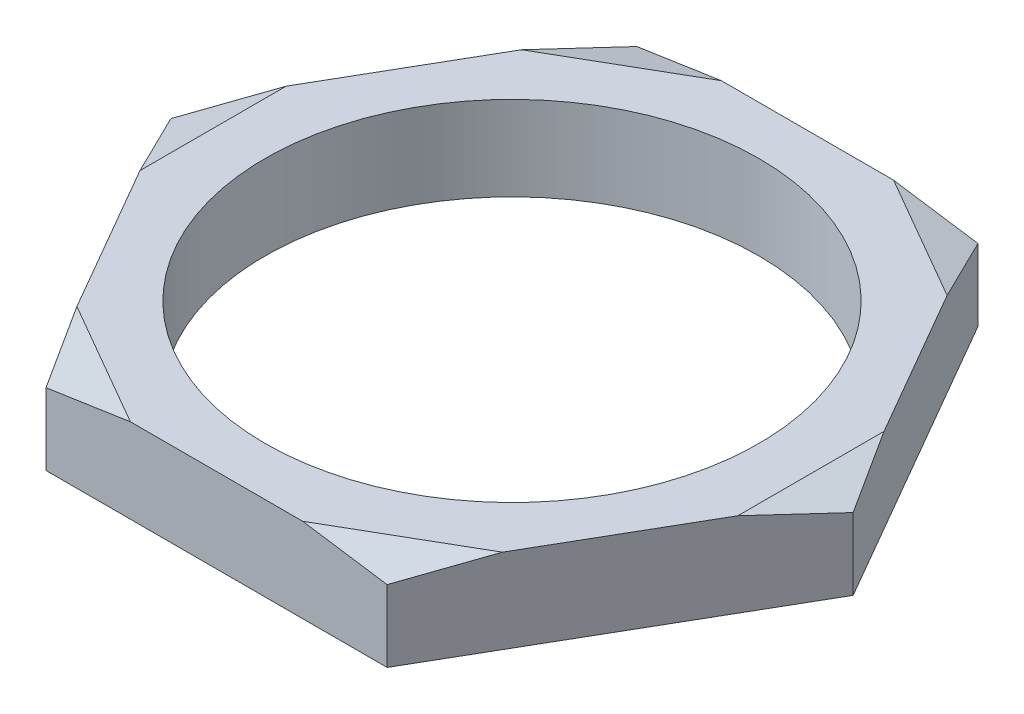
ISO-10303-21;
HEADER;
FILE_DESCRIPTION(('STEP AP214'),'2;1');
FILE_NAME('part.step','',(''),(''),'','','');
FILE_SCHEMA(('AUTOMOTIVE_DESIGN { 1 0 10303 214 1 1 1 1 }'));
ENDSEC;
DATA;
#1=APPLICATION_CONTEXT('core data for automotive mechanical design processes');
#2=APPLICATION_PROTOCOL_DEFINITION('international standard','automotive_design',2000,#1);
#3=PRODUCT_CONTEXT('',#1,'mechanical');
#4=PRODUCT('Part','Part','',(#3));
#5=PRODUCT_RELATED_PRODUCT_CATEGORY('part','',(#4));
#6=PRODUCT_DEFINITION_FORMATION('','',#4);
#7=PRODUCT_DEFINITION_CONTEXT('part definition',#1,'design');
#8=PRODUCT_DEFINITION('design','',#6,#7);
#9=PRODUCT_DEFINITION_SHAPE('','',#8);
#10=(LENGTH_UNIT() NAMED_UNIT(*) SI_UNIT(.MILLI.,.METRE.));
#11=(NAMED_UNIT(*) PLANE_ANGLE_UNIT() SI_UNIT($,.RADIAN.));
#12=(NAMED_UNIT(*) SI_UNIT($,.STERADIAN.) SOLID_ANGLE_UNIT());
#13=UNCERTAINTY_MEASURE_WITH_UNIT(LENGTH_MEASURE(1.E-05),#10,'distance_accuracy_value','');
#14=(GEOMETRIC_REPRESENTATION_CONTEXT(3) GLOBAL_UNCERTAINTY_ASSIGNED_CONTEXT((#13)) GLOBAL_UNIT_ASSIGNED_CONTEXT((#10,
#11,#12)) REPRESENTATION_CONTEXT('',''));
#15=CARTESIAN_POINT('',(0.,0.,0.));
#16=DIRECTION('',(0.,0.,1.));
#17=DIRECTION('',(1.,0.,0.));
#18=AXIS2_PLACEMENT_3D('',#15,#16,#17);
#19=CARTESIAN_POINT('',(0.,2.,0.));
#20=DIRECTION('',(0.,1.,0.));
#21=DIRECTION('',(0.,0.,1.));
#22=AXIS2_PLACEMENT_3D('',#19,#20,#21);
#23=PLANE('',#22);
#24=CARTESIAN_POINT('',(0.,2.,0.));
#25=DIRECTION('',(0.,1.,0.));
#26=DIRECTION('',(0.,0.,1.));
#27=AXIS2_PLACEMENT_3D('',#24,#25,#26);
#28=CIRCLE('',#27,5.85);
#29=CARTESIAN_POINT('',(0.,2.,5.85));
#30=VERTEX_POINT('',#29);
#31=EDGE_CURVE('E207',#30,#30,#28,.T.);
#32=ORIENTED_EDGE('',*,*,#31,.F.);
#33=EDGE_LOOP('',(#32));
#34=FACE_BOUND('',#33,.T.);
#35=DIRECTION('',(-0.499999999999995,0.,0.866025403784442));
#36=VECTOR('',#35,1.);
#37=CARTESIAN_POINT('',(-4.04145188432746,2.,-6.99999999999996));
#38=LINE('',#37,#36);
#39=CARTESIAN_POINT('',(-5.04145188432745,2.,-5.26794919243108));
#40=VERTEX_POINT('',#39);
#41=CARTESIAN_POINT('',(-7.08290376865478,2.,-1.73205080756888));
#42=VERTEX_POINT('',#41);
#43=EDGE_CURVE('E127',#40,#42,#38,.T.);
#44=ORIENTED_EDGE('',*,*,#43,.T.);
#45=DIRECTION('',(0.,0.,1.));
#46=VECTOR('',#45,1.);
#47=CARTESIAN_POINT('',(-7.08290376865477,2.,0.));
#48=LINE('',#47,#46);
#49=CARTESIAN_POINT('',(-7.08290376865476,2.,1.73205080756888));
#50=VERTEX_POINT('',#49);
#51=EDGE_CURVE('E130',#42,#50,#48,.T.);
#52=ORIENTED_EDGE('',*,*,#51,.T.);
#53=DIRECTION('',(0.500000000000001,0.,0.866025403784438));
#54=VECTOR('',#53,1.);
#55=CARTESIAN_POINT('',(-8.08290376865476,2.,0.));
#56=LINE('',#55,#54);
#57=CARTESIAN_POINT('',(-5.04145188432738,2.,5.26794919243113));
#58=VERTEX_POINT('',#57);
#59=EDGE_CURVE('E117',#50,#58,#56,.T.);
#60=ORIENTED_EDGE('',*,*,#59,.T.);
#61=DIRECTION('',(0.86602540378444,0.,0.499999999999998));
#62=VECTOR('',#61,1.);
#63=CARTESIAN_POINT('',(-3.54145188432736,2.,6.13397459621556));
#64=LINE('',#63,#62);
#65=CARTESIAN_POINT('',(-2.04145188432735,2.,7.00000000000001));
#66=VERTEX_POINT('',#65);
#67=EDGE_CURVE('E156',#58,#66,#64,.T.);
#68=ORIENTED_EDGE('',*,*,#67,.T.);
#69=DIRECTION('',(1.,0.,0.));
#70=VECTOR('',#69,1.);
#71=CARTESIAN_POINT('',(-4.04145188432737,2.,7.00000000000001));
#72=LINE('',#71,#70);
#73=CARTESIAN_POINT('',(2.04145188432741,2.,6.99999999999999));
#74=VERTEX_POINT('',#73);
#75=EDGE_CURVE('E126',#66,#74,#72,.T.);
#76=ORIENTED_EDGE('',*,*,#75,.T.);
#77=DIRECTION('',(0.866025403784436,0.,-0.500000000000004));
#78=VECTOR('',#77,1.);
#79=CARTESIAN_POINT('',(3.54145188432741,2.,6.13397459621554));
#80=LINE('',#79,#78);
#81=CARTESIAN_POINT('',(5.04145188432741,2.,5.2679491924311));
#82=VERTEX_POINT('',#81);
#83=EDGE_CURVE('E173',#74,#82,#80,.T.);
#84=ORIENTED_EDGE('',*,*,#83,.T.);
#85=DIRECTION('',(0.499999999999995,0.,-0.866025403784441));
#86=VECTOR('',#85,1.);
#87=CARTESIAN_POINT('',(4.04145188432742,2.,6.99999999999998));
#88=LINE('',#87,#86);
#89=CARTESIAN_POINT('',(7.08290376865477,2.,1.73205080756883));
#90=VERTEX_POINT('',#89);
#91=EDGE_CURVE('E213',#82,#90,#88,.T.);
#92=ORIENTED_EDGE('',*,*,#91,.T.);
#93=DIRECTION('',(0.,0.,-1.));
#94=VECTOR('',#93,1.);
#95=CARTESIAN_POINT('',(7.08290376865476,2.,0.));
#96=LINE('',#95,#94);
#97=CARTESIAN_POINT('',(7.08290376865475,2.,-1.73205080756893));
#98=VERTEX_POINT('',#97);
#99=EDGE_CURVE('E164',#90,#98,#96,.T.);
#100=ORIENTED_EDGE('',*,*,#99,.T.);
#101=DIRECTION('',(-0.500000000000007,0.,-0.866025403784435));
#102=VECTOR('',#101,1.);
#103=CARTESIAN_POINT('',(8.08290376865476,2.,0.));
#104=LINE('',#103,#102);
#105=CARTESIAN_POINT('',(5.04145188432733,2.,-5.26794919243118));
#106=VERTEX_POINT('',#105);
#107=EDGE_CURVE('E210',#98,#106,#104,.T.);
#108=ORIENTED_EDGE('',*,*,#107,.T.);
#109=DIRECTION('',(-0.866025403784443,0.,-0.499999999999992));
#110=VECTOR('',#109,1.);
#111=CARTESIAN_POINT('',(3.54145188432733,2.,-6.1339745962156));
#112=LINE('',#111,#110);
#113=CARTESIAN_POINT('',(2.04145188432732,2.,-7.00000000000002));
#114=VERTEX_POINT('',#113);
#115=EDGE_CURVE('E149',#106,#114,#112,.T.);
#116=ORIENTED_EDGE('',*,*,#115,.T.);
#117=DIRECTION('',(-1.,0.,0.));
#118=VECTOR('',#117,1.);
#119=CARTESIAN_POINT('',(4.04145188432732,2.,-7.00000000000004));
#120=LINE('',#119,#118);
#121=CARTESIAN_POINT('',(-2.04145188432747,2.,-6.99999999999998));
#122=VERTEX_POINT('',#121);
#123=EDGE_CURVE('E188',#114,#122,#120,.T.);
#124=ORIENTED_EDGE('',*,*,#123,.T.);
#125=DIRECTION('',(-0.866025403784434,0.,0.500000000000007));
#126=VECTOR('',#125,1.);
#127=CARTESIAN_POINT('',(-3.54145188432744,2.,-6.13397459621554));
#128=LINE('',#127,#126);
#129=EDGE_CURVE('E141',#122,#40,#128,.T.);
#130=ORIENTED_EDGE('',*,*,#129,.T.);
#131=EDGE_LOOP('',(#44,#52,#60,#68,#76,#84,#92,#100,#108,#116,#124,#130));
#132=FACE_BOUND('',#131,.T.);
#133=ADVANCED_FACE('F32',(#34,#132),#23,.T.);
#134=CARTESIAN_POINT('',(0.,0.,0.));
#135=DIRECTION('',(0.,1.,0.));
#136=DIRECTION('',(0.,0.,1.));
#137=AXIS2_PLACEMENT_3D('',#134,#135,#136);
#138=PLANE('',#137);
#139=DIRECTION('',(-0.499999999999995,0.,0.866025403784442));
#140=VECTOR('',#139,1.);
#141=CARTESIAN_POINT('',(-4.04145188432746,0.,-6.99999999999996));
#142=LINE('',#141,#140);
#143=CARTESIAN_POINT('',(-4.04145188432746,0.,-6.99999999999996));
#144=VERTEX_POINT('',#143);
#145=CARTESIAN_POINT('',(-8.08290376865476,0.,0.));
#146=VERTEX_POINT('',#145);
#147=EDGE_CURVE('E204',#144,#146,#142,.T.);
#148=ORIENTED_EDGE('',*,*,#147,.F.);
#149=DIRECTION('',(-1.,0.,0.));
#150=VECTOR('',#149,1.);
#151=CARTESIAN_POINT('',(4.04145188432732,0.,-7.00000000000004));
#152=LINE('',#151,#150);
#153=CARTESIAN_POINT('',(4.04145188432732,0.,-7.00000000000004));
#154=VERTEX_POINT('',#153);
#155=EDGE_CURVE('E189',#154,#144,#152,.T.);
#156=ORIENTED_EDGE('',*,*,#155,.F.);
#157=DIRECTION('',(-0.500000000000007,0.,-0.866025403784435));
#158=VECTOR('',#157,1.);
#159=CARTESIAN_POINT('',(8.08290376865476,0.,0.));
#160=LINE('',#159,#158);
#161=CARTESIAN_POINT('',(8.08290376865476,0.,0.));
#162=VERTEX_POINT('',#161);
#163=EDGE_CURVE('E192',#162,#154,#160,.T.);
#164=ORIENTED_EDGE('',*,*,#163,.F.);
#165=DIRECTION('',(0.499999999999995,0.,-0.866025403784441));
#166=VECTOR('',#165,1.);
#167=CARTESIAN_POINT('',(4.04145188432742,0.,6.99999999999998));
#168=LINE('',#167,#166);
#169=CARTESIAN_POINT('',(4.04145188432742,0.,6.99999999999998));
#170=VERTEX_POINT('',#169);
#171=EDGE_CURVE('E195',#170,#162,#168,.T.);
#172=ORIENTED_EDGE('',*,*,#171,.F.);
#173=DIRECTION('',(1.,0.,0.));
#174=VECTOR('',#173,1.);
#175=CARTESIAN_POINT('',(-4.04145188432737,0.,7.00000000000001));
#176=LINE('',#175,#174);
#177=CARTESIAN_POINT('',(-4.04145188432737,0.,7.00000000000001));
#178=VERTEX_POINT('',#177);
#179=EDGE_CURVE('E198',#178,#170,#176,.T.);
#180=ORIENTED_EDGE('',*,*,#179,.F.);
#181=DIRECTION('',(0.500000000000001,0.,0.866025403784438));
#182=VECTOR('',#181,1.);
#183=CARTESIAN_POINT('',(-8.08290376865476,0.,0.));
#184=LINE('',#183,#182);
#185=EDGE_CURVE('E201',#146,#178,#184,.T.);
#186=ORIENTED_EDGE('',*,*,#185,.F.);
#187=EDGE_LOOP('',(#148,#156,#164,#172,#180,#186));
#188=FACE_BOUND('',#187,.T.);
#189=CARTESIAN_POINT('',(0.,0.,0.));
#190=DIRECTION('',(0.,1.,0.));
#191=DIRECTION('',(0.,0.,1.));
#192=AXIS2_PLACEMENT_3D('',#189,#190,#191);
#193=CIRCLE('',#192,5.85);
#194=CARTESIAN_POINT('',(0.,0.,5.85));
#195=VERTEX_POINT('',#194);
#196=EDGE_CURVE('E218',#195,#195,#193,.T.);
#197=ORIENTED_EDGE('',*,*,#196,.T.);
#198=EDGE_LOOP('',(#197));
#199=FACE_BOUND('',#198,.T.);
#200=ADVANCED_FACE('F228',(#188,#199),#138,.F.);
#201=CARTESIAN_POINT('',(-4.04145188432746,2.,-6.99999999999996));
#202=DIRECTION('',(0.866025403784442,0.,0.499999999999995));
#203=DIRECTION('',(0.499999999999995,0.,-0.866025403784442));
#204=AXIS2_PLACEMENT_3D('',#201,#202,#203);
#205=PLANE('',#204);
#206=DIRECTION('',(-0.494468176434144,-0.148340452930245,0.85644400430988));
#207=VECTOR('',#206,1.);
#208=CARTESIAN_POINT('',(-4.10837869840802,2.89235752107404,-6.88407935762372));
#209=LINE('',#208,#207);
#210=CARTESIAN_POINT('',(-8.08290376865476,1.7,0.));
#211=VERTEX_POINT('',#210);
#212=EDGE_CURVE('E40',#42,#211,#209,.T.);
#213=ORIENTED_EDGE('',*,*,#212,.F.);
#214=ORIENTED_EDGE('',*,*,#43,.F.);
#215=DIRECTION('',(-0.494468176434144,0.148340452930245,0.85644400430988));
#216=VECTOR('',#215,1.);
#217=CARTESIAN_POINT('',(-4.06345677430301,1.70660146699267,-6.96188641254734));
#218=LINE('',#217,#216);
#219=CARTESIAN_POINT('',(-4.04145188432746,1.7,-6.99999999999996));
#220=VERTEX_POINT('',#219);
#221=EDGE_CURVE('E138',#220,#40,#218,.T.);
#222=ORIENTED_EDGE('',*,*,#221,.F.);
#223=DIRECTION('',(0.,-1.,0.));
#224=VECTOR('',#223,1.);
#225=CARTESIAN_POINT('',(-4.04145188432746,2.,-6.99999999999996));
#226=LINE('',#225,#224);
#227=EDGE_CURVE('E186',#220,#144,#226,.T.);
#228=ORIENTED_EDGE('',*,*,#227,.T.);
#229=ORIENTED_EDGE('',*,*,#147,.T.);
#230=DIRECTION('',(0.,-1.,0.));
#231=VECTOR('',#230,1.);
#232=CARTESIAN_POINT('',(-8.08290376865476,2.,0.));
#233=LINE('',#232,#231);
#234=EDGE_CURVE('E176',#211,#146,#233,.T.);
#235=ORIENTED_EDGE('',*,*,#234,.F.);
#236=EDGE_LOOP('',(#213,#214,#222,#228,#229,#235));
#237=FACE_BOUND('',#236,.T.);
#238=ADVANCED_FACE('F34',(#237),#205,.F.);
#239=CARTESIAN_POINT('',(-8.08290376865476,2.,0.));
#240=DIRECTION('',(0.866025403784438,0.,-0.500000000000001));
#241=DIRECTION('',(-0.500000000000001,0.,-0.866025403784438));
#242=AXIS2_PLACEMENT_3D('',#239,#240,#241);
#243=PLANE('',#242);
#244=DIRECTION('',(0.49446817643415,0.148340452930245,0.856444004309877));
#245=VECTOR('',#244,1.);
#246=CARTESIAN_POINT('',(-8.06089887867921,1.70660146699267,0.0381135874526158));
#247=LINE('',#246,#245);
#248=EDGE_CURVE('E11',#211,#50,#247,.T.);
#249=ORIENTED_EDGE('',*,*,#248,.F.);
#250=ORIENTED_EDGE('',*,*,#234,.T.);
#251=ORIENTED_EDGE('',*,*,#185,.T.);
#252=DIRECTION('',(0.,-1.,0.));
#253=VECTOR('',#252,1.);
#254=CARTESIAN_POINT('',(-4.04145188432737,2.,7.00000000000001));
#255=LINE('',#254,#253);
#256=CARTESIAN_POINT('',(-4.04145188432737,1.7,7.00000000000001));
#257=VERTEX_POINT('',#256);
#258=EDGE_CURVE('E178',#257,#178,#255,.T.);
#259=ORIENTED_EDGE('',*,*,#258,.F.);
#260=DIRECTION('',(0.49446817643415,-0.148340452930245,0.856444004309877));
#261=VECTOR('',#260,1.);
#262=CARTESIAN_POINT('',(-8.01597695457421,2.89235752107405,0.115920642376235));
#263=LINE('',#262,#261);
#264=EDGE_CURVE('E122',#58,#257,#263,.T.);
#265=ORIENTED_EDGE('',*,*,#264,.F.);
#266=ORIENTED_EDGE('',*,*,#59,.F.);
#267=EDGE_LOOP('',(#249,#250,#251,#259,#265,#266));
#268=FACE_BOUND('',#267,.T.);
#269=ADVANCED_FACE('F119',(#268),#243,.F.);
#270=CARTESIAN_POINT('',(-4.04145188432737,2.,7.00000000000001));
#271=DIRECTION('',(0.,0.,-1.));
#272=DIRECTION('',(-1.,0.,0.));
#273=AXIS2_PLACEMENT_3D('',#270,#271,#272);
#274=PLANE('',#273);
#275=DIRECTION('',(0.988936352868298,0.148340452930245,0.));
#276=VECTOR('',#275,1.);
#277=CARTESIAN_POINT('',(-3.99744210437627,1.70660146699266,7.00000000000001));
#278=LINE('',#277,#276);
#279=EDGE_CURVE('E152',#257,#66,#278,.T.);
#280=ORIENTED_EDGE('',*,*,#279,.F.);
#281=ORIENTED_EDGE('',*,*,#258,.T.);
#282=ORIENTED_EDGE('',*,*,#179,.T.);
#283=DIRECTION('',(0.,-1.,0.));
#284=VECTOR('',#283,1.);
#285=CARTESIAN_POINT('',(4.04145188432742,2.,6.99999999999998));
#286=LINE('',#285,#284);
#287=CARTESIAN_POINT('',(4.04145188432742,1.7,6.99999999999998));
#288=VERTEX_POINT('',#287);
#289=EDGE_CURVE('E180',#288,#170,#286,.T.);
#290=ORIENTED_EDGE('',*,*,#289,.F.);
#291=DIRECTION('',(0.988936352868298,-0.148340452930245,0.));
#292=VECTOR('',#291,1.);
#293=CARTESIAN_POINT('',(-3.90759825616626,2.89235752107405,7.00000000000001));
#294=LINE('',#293,#292);
#295=EDGE_CURVE('E170',#74,#288,#294,.T.);
#296=ORIENTED_EDGE('',*,*,#295,.F.);
#297=ORIENTED_EDGE('',*,*,#75,.F.);
#298=EDGE_LOOP('',(#280,#281,#282,#290,#296,#297));
#299=FACE_BOUND('',#298,.T.);
#300=ADVANCED_FACE('F249',(#299),#274,.F.);
#301=CARTESIAN_POINT('',(4.04145188432742,2.,6.99999999999998));
#302=DIRECTION('',(-0.866025403784441,0.,-0.499999999999995));
#303=DIRECTION('',(-0.499999999999995,0.,0.866025403784442));
#304=AXIS2_PLACEMENT_3D('',#301,#302,#303);
#305=PLANE('',#304);
#306=DIRECTION('',(0.494468176434144,-0.148340452930245,-0.85644400430988));
#307=VECTOR('',#306,1.);
#308=CARTESIAN_POINT('',(4.10837869840797,2.89235752107405,6.88407935762375));
#309=LINE('',#308,#307);
#310=CARTESIAN_POINT('',(8.08290376865476,1.7,0.));
#311=VERTEX_POINT('',#310);
#312=EDGE_CURVE('E161',#90,#311,#309,.T.);
#313=ORIENTED_EDGE('',*,*,#312,.F.);
#314=ORIENTED_EDGE('',*,*,#91,.F.);
#315=DIRECTION('',(0.494468176434144,0.148340452930245,-0.85644400430988));
#316=VECTOR('',#315,1.);
#317=CARTESIAN_POINT('',(4.06345677430296,1.70660146699266,6.96188641254737));
#318=LINE('',#317,#316);
#319=EDGE_CURVE('E167',#288,#82,#318,.T.);
#320=ORIENTED_EDGE('',*,*,#319,.F.);
#321=ORIENTED_EDGE('',*,*,#289,.T.);
#322=ORIENTED_EDGE('',*,*,#171,.T.);
#323=DIRECTION('',(0.,-1.,0.));
#324=VECTOR('',#323,1.);
#325=CARTESIAN_POINT('',(8.08290376865476,2.,0.));
#326=LINE('',#325,#324);
#327=EDGE_CURVE('E182',#311,#162,#326,.T.);
#328=ORIENTED_EDGE('',*,*,#327,.F.);
#329=EDGE_LOOP('',(#313,#314,#320,#321,#322,#328));
#330=FACE_BOUND('',#329,.T.);
#331=ADVANCED_FACE('F245',(#330),#305,.F.);
#332=CARTESIAN_POINT('',(8.08290376865476,2.,0.));
#333=DIRECTION('',(-0.866025403784435,0.,0.500000000000007));
#334=DIRECTION('',(0.500000000000007,0.,0.866025403784435));
#335=AXIS2_PLACEMENT_3D('',#332,#333,#334);
#336=PLANE('',#335);
#337=DIRECTION('',(-0.494468176434156,-0.148340452930245,-0.856444004309873));
#338=VECTOR('',#337,1.);
#339=CARTESIAN_POINT('',(8.01597695457421,2.89235752107405,-0.115920642376292));
#340=LINE('',#339,#338);
#341=CARTESIAN_POINT('',(4.04145188432732,1.7,-7.00000000000004));
#342=VERTEX_POINT('',#341);
#343=EDGE_CURVE('E146',#106,#342,#340,.T.);
#344=ORIENTED_EDGE('',*,*,#343,.F.);
#345=ORIENTED_EDGE('',*,*,#107,.F.);
#346=DIRECTION('',(-0.494468176434156,0.148340452930245,-0.856444004309873));
#347=VECTOR('',#346,1.);
#348=CARTESIAN_POINT('',(8.06089887867921,1.70660146699266,-0.0381135874526722));
#349=LINE('',#348,#347);
#350=EDGE_CURVE('E158',#311,#98,#349,.T.);
#351=ORIENTED_EDGE('',*,*,#350,.F.);
#352=ORIENTED_EDGE('',*,*,#327,.T.);
#353=ORIENTED_EDGE('',*,*,#163,.T.);
#354=DIRECTION('',(0.,-1.,0.));
#355=VECTOR('',#354,1.);
#356=CARTESIAN_POINT('',(4.04145188432732,2.,-7.00000000000004));
#357=LINE('',#356,#355);
#358=EDGE_CURVE('E184',#342,#154,#357,.T.);
#359=ORIENTED_EDGE('',*,*,#358,.F.);
#360=EDGE_LOOP('',(#344,#345,#351,#352,#353,#359));
#361=FACE_BOUND('',#360,.T.);
#362=ADVANCED_FACE('F241',(#361),#336,.F.);
#363=CARTESIAN_POINT('',(4.04145188432732,2.,-7.00000000000004));
#364=DIRECTION('',(0.,0.,1.));
#365=DIRECTION('',(1.,0.,0.));
#366=AXIS2_PLACEMENT_3D('',#363,#364,#365);
#367=PLANE('',#366);
#368=DIRECTION('',(-0.988936352868298,-0.148340452930245,0.));
#369=VECTOR('',#368,1.);
#370=CARTESIAN_POINT('',(3.90759825616621,2.89235752107405,-7.00000000000004));
#371=LINE('',#370,#369);
#372=EDGE_CURVE('E132',#122,#220,#371,.T.);
#373=ORIENTED_EDGE('',*,*,#372,.F.);
#374=ORIENTED_EDGE('',*,*,#123,.F.);
#375=DIRECTION('',(-0.988936352868298,0.148340452930245,0.));
#376=VECTOR('',#375,1.);
#377=CARTESIAN_POINT('',(3.99744210437622,1.70660146699267,-7.00000000000004));
#378=LINE('',#377,#376);
#379=EDGE_CURVE('E143',#342,#114,#378,.T.);
#380=ORIENTED_EDGE('',*,*,#379,.F.);
#381=ORIENTED_EDGE('',*,*,#358,.T.);
#382=ORIENTED_EDGE('',*,*,#155,.T.);
#383=ORIENTED_EDGE('',*,*,#227,.F.);
#384=EDGE_LOOP('',(#373,#374,#380,#381,#382,#383));
#385=FACE_BOUND('',#384,.T.);
#386=ADVANCED_FACE('F238',(#385),#367,.F.);
#387=CARTESIAN_POINT('',(0.,2.,0.));
#388=DIRECTION('',(0.,-1.,0.));
#389=DIRECTION('',(0.,0.,-1.));
#390=AXIS2_PLACEMENT_3D('',#387,#388,#389);
#391=CYLINDRICAL_SURFACE('',#390,5.85);
#392=ORIENTED_EDGE('',*,*,#31,.T.);
#393=EDGE_LOOP('',(#392));
#394=FACE_BOUND('',#393,.T.);
#395=ORIENTED_EDGE('',*,*,#196,.F.);
#396=EDGE_LOOP('',(#395));
#397=FACE_BOUND('',#396,.T.);
#398=ADVANCED_FACE('F224',(#394,#397),#391,.F.);
#399=CARTESIAN_POINT('',(0.567642816137126,3.78428544091415,0.983186198100971));
#400=DIRECTION('',(0.143673942783174,0.957826285221152,0.248850568624198));
#401=DIRECTION('',(0.,-0.2514594403022,0.967867836991655));
#402=AXIS2_PLACEMENT_3D('',#399,#400,#401);
#403=PLANE('',#402);
#404=ORIENTED_EDGE('',*,*,#83,.F.);
#405=ORIENTED_EDGE('',*,*,#295,.T.);
#406=ORIENTED_EDGE('',*,*,#319,.T.);
#407=EDGE_LOOP('',(#404,#405,#406));
#408=FACE_BOUND('',#407,.T.);
#409=ADVANCED_FACE('F272',(#408),#403,.T.);
#410=CARTESIAN_POINT('',(1.13528563227424,3.78428544091415,0.));
#411=DIRECTION('',(0.287347885566345,0.957826285221152,0.));
#412=DIRECTION('',(-0.957826285221152,0.287347885566345,0.));
#413=AXIS2_PLACEMENT_3D('',#410,#411,#412);
#414=PLANE('',#413);
#415=ORIENTED_EDGE('',*,*,#99,.F.);
#416=ORIENTED_EDGE('',*,*,#312,.T.);
#417=ORIENTED_EDGE('',*,*,#350,.T.);
#418=EDGE_LOOP('',(#415,#416,#417));
#419=FACE_BOUND('',#418,.T.);
#420=ADVANCED_FACE('F281',(#419),#414,.T.);
#421=CARTESIAN_POINT('',(-0.567642816137119,3.78428544091415,0.983186198100974));
#422=DIRECTION('',(-0.143673942783172,0.957826285221151,0.248850568624199));
#423=DIRECTION('',(0.,-0.251459440302201,0.967867836991655));
#424=AXIS2_PLACEMENT_3D('',#421,#422,#423);
#425=PLANE('',#424);
#426=ORIENTED_EDGE('',*,*,#67,.F.);
#427=ORIENTED_EDGE('',*,*,#264,.T.);
#428=ORIENTED_EDGE('',*,*,#279,.T.);
#429=EDGE_LOOP('',(#426,#427,#428));
#430=FACE_BOUND('',#429,.T.);
#431=ADVANCED_FACE('F298',(#430),#425,.T.);
#432=CARTESIAN_POINT('',(0.567642816137113,3.78428544091415,-0.98318619810098));
#433=DIRECTION('',(0.14367394278317,0.957826285221152,-0.2488505686242));
#434=DIRECTION('',(0.,0.251459440302202,0.967867836991654));
#435=AXIS2_PLACEMENT_3D('',#432,#433,#434);
#436=PLANE('',#435);
#437=ORIENTED_EDGE('',*,*,#115,.F.);
#438=ORIENTED_EDGE('',*,*,#343,.T.);
#439=ORIENTED_EDGE('',*,*,#379,.T.);
#440=EDGE_LOOP('',(#437,#438,#439));
#441=FACE_BOUND('',#440,.T.);
#442=ADVANCED_FACE('F314',(#441),#436,.T.);
#443=CARTESIAN_POINT('',(-0.567642816137135,3.78428544091416,-0.983186198100977));
#444=DIRECTION('',(-0.143673942783175,0.957826285221151,-0.248850568624199));
#445=DIRECTION('',(0.,0.2514594403022,0.967867836991655));
#446=AXIS2_PLACEMENT_3D('',#443,#444,#445);
#447=PLANE('',#446);
#448=ORIENTED_EDGE('',*,*,#129,.F.);
#449=ORIENTED_EDGE('',*,*,#372,.T.);
#450=ORIENTED_EDGE('',*,*,#221,.T.);
#451=EDGE_LOOP('',(#448,#449,#450));
#452=FACE_BOUND('',#451,.T.);
#453=ADVANCED_FACE('F329',(#452),#447,.T.);
#454=CARTESIAN_POINT('',(-1.13528563227425,3.78428544091416,0.));
#455=DIRECTION('',(-0.287347885566346,0.957826285221151,0.));
#456=DIRECTION('',(-0.957826285221151,-0.287347885566346,0.));
#457=AXIS2_PLACEMENT_3D('',#454,#455,#456);
#458=PLANE('',#457);
#459=ORIENTED_EDGE('',*,*,#51,.F.);
#460=ORIENTED_EDGE('',*,*,#212,.T.);
#461=ORIENTED_EDGE('',*,*,#248,.T.);
#462=EDGE_LOOP('',(#459,#460,#461));
#463=FACE_BOUND('',#462,.T.);
#464=ADVANCED_FACE('F134',(#463),#458,.T.);
#465=CLOSED_SHELL('',(#133,#200,#238,#269,#300,#331,#362,#386,#398,#409,#420,#431,#442,#453,#464));
#466=MANIFOLD_SOLID_BREP('B2',#465);
#467=ADVANCED_BREP_SHAPE_REPRESENTATION('',(#18,#466),#14);
#468=SHAPE_DEFINITION_REPRESENTATION(#9,#467);
ENDSEC;
END-ISO-10303-21;
